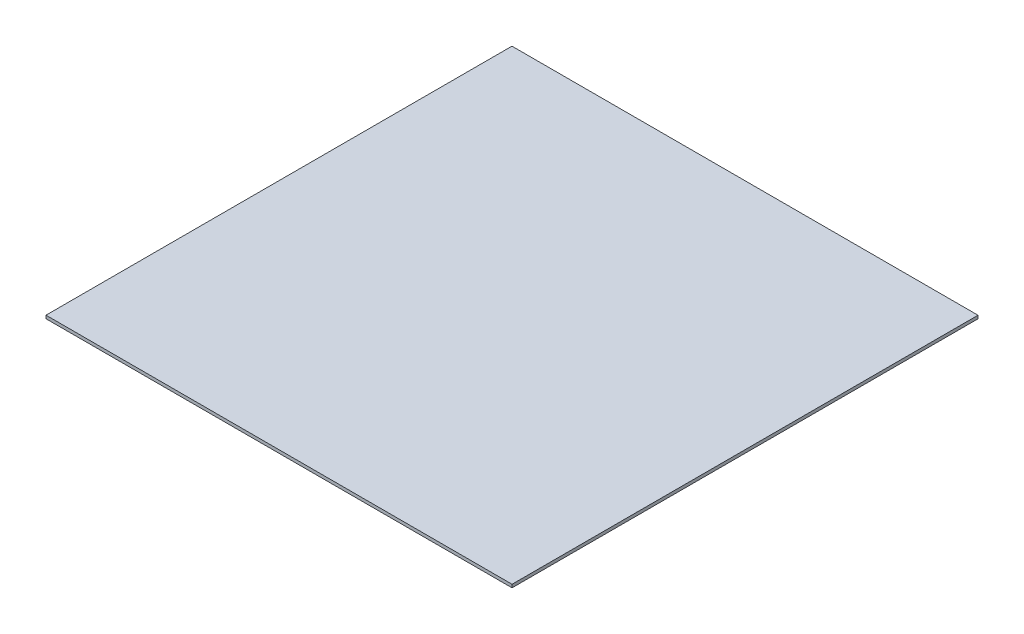
ISO-10303-21;
HEADER;
FILE_DESCRIPTION(('STEP AP214'),'2;1');
FILE_NAME('part.step','',(''),(''),'','','');
FILE_SCHEMA(('AUTOMOTIVE_DESIGN { 1 0 10303 214 1 1 1 1 }'));
ENDSEC;
DATA;
#1=APPLICATION_CONTEXT('core data for automotive mechanical design processes');
#2=APPLICATION_PROTOCOL_DEFINITION('international standard','automotive_design',2000,#1);
#3=PRODUCT_CONTEXT('',#1,'mechanical');
#4=PRODUCT('Part','Part','',(#3));
#5=PRODUCT_RELATED_PRODUCT_CATEGORY('part','',(#4));
#6=PRODUCT_DEFINITION_FORMATION('','',#4);
#7=PRODUCT_DEFINITION_CONTEXT('part definition',#1,'design');
#8=PRODUCT_DEFINITION('design','',#6,#7);
#9=PRODUCT_DEFINITION_SHAPE('','',#8);
#10=(LENGTH_UNIT() NAMED_UNIT(*) SI_UNIT(.MILLI.,.METRE.));
#11=(NAMED_UNIT(*) PLANE_ANGLE_UNIT() SI_UNIT($,.RADIAN.));
#12=(NAMED_UNIT(*) SI_UNIT($,.STERADIAN.) SOLID_ANGLE_UNIT());
#13=UNCERTAINTY_MEASURE_WITH_UNIT(LENGTH_MEASURE(1.E-05),#10,'distance_accuracy_value','');
#14=(GEOMETRIC_REPRESENTATION_CONTEXT(3) GLOBAL_UNCERTAINTY_ASSIGNED_CONTEXT((#13)) GLOBAL_UNIT_ASSIGNED_CONTEXT((#10,
#11,#12)) REPRESENTATION_CONTEXT('',''));
#15=CARTESIAN_POINT('',(0.,0.,0.));
#16=DIRECTION('',(0.,0.,1.));
#17=DIRECTION('',(1.,0.,0.));
#18=AXIS2_PLACEMENT_3D('',#15,#16,#17);
#19=CARTESIAN_POINT('',(-149.08,2.,149.05));
#20=DIRECTION('',(1.,0.,0.));
#21=DIRECTION('',(0.,0.,-1.));
#22=AXIS2_PLACEMENT_3D('',#19,#20,#21);
#23=PLANE('',#22);
#24=DIRECTION('',(0.,0.,1.));
#25=VECTOR('',#24,1.);
#26=CARTESIAN_POINT('',(-149.08,0.,149.05));
#27=LINE('',#26,#25);
#28=CARTESIAN_POINT('',(-149.08,0.,-149.05));
#29=VERTEX_POINT('',#28);
#30=CARTESIAN_POINT('',(-149.08,0.,149.05));
#31=VERTEX_POINT('',#30);
#32=EDGE_CURVE('E111',#29,#31,#27,.T.);
#33=ORIENTED_EDGE('',*,*,#32,.T.);
#34=DIRECTION('',(0.,-1.,0.));
#35=VECTOR('',#34,1.);
#36=CARTESIAN_POINT('',(-149.08,2.,149.05));
#37=LINE('',#36,#35);
#38=CARTESIAN_POINT('',(-149.08,2.,149.05));
#39=VERTEX_POINT('',#38);
#40=EDGE_CURVE('E11',#39,#31,#37,.T.);
#41=ORIENTED_EDGE('',*,*,#40,.F.);
#42=DIRECTION('',(0.,0.,1.));
#43=VECTOR('',#42,1.);
#44=CARTESIAN_POINT('',(-149.08,2.,149.05));
#45=LINE('',#44,#43);
#46=CARTESIAN_POINT('',(-149.08,2.,-149.05));
#47=VERTEX_POINT('',#46);
#48=EDGE_CURVE('E95',#47,#39,#45,.T.);
#49=ORIENTED_EDGE('',*,*,#48,.F.);
#50=DIRECTION('',(0.,-1.,0.));
#51=VECTOR('',#50,1.);
#52=CARTESIAN_POINT('',(-149.08,2.,-149.05));
#53=LINE('',#52,#51);
#54=EDGE_CURVE('E107',#47,#29,#53,.T.);
#55=ORIENTED_EDGE('',*,*,#54,.T.);
#56=EDGE_LOOP('',(#33,#41,#49,#55));
#57=FACE_BOUND('',#56,.T.);
#58=ADVANCED_FACE('F43',(#57),#23,.F.);
#59=CARTESIAN_POINT('',(149.08,2.,149.05));
#60=DIRECTION('',(0.,0.,-1.));
#61=DIRECTION('',(-1.,0.,0.));
#62=AXIS2_PLACEMENT_3D('',#59,#60,#61);
#63=PLANE('',#62);
#64=DIRECTION('',(1.,0.,0.));
#65=VECTOR('',#64,1.);
#66=CARTESIAN_POINT('',(149.08,0.,149.05));
#67=LINE('',#66,#65);
#68=CARTESIAN_POINT('',(149.08,0.,149.05));
#69=VERTEX_POINT('',#68);
#70=EDGE_CURVE('E100',#31,#69,#67,.T.);
#71=ORIENTED_EDGE('',*,*,#70,.T.);
#72=DIRECTION('',(0.,-1.,0.));
#73=VECTOR('',#72,1.);
#74=CARTESIAN_POINT('',(149.08,2.,149.05));
#75=LINE('',#74,#73);
#76=CARTESIAN_POINT('',(149.08,2.,149.05));
#77=VERTEX_POINT('',#76);
#78=EDGE_CURVE('E52',#77,#69,#75,.T.);
#79=ORIENTED_EDGE('',*,*,#78,.F.);
#80=DIRECTION('',(1.,0.,0.));
#81=VECTOR('',#80,1.);
#82=CARTESIAN_POINT('',(149.08,2.,149.05));
#83=LINE('',#82,#81);
#84=EDGE_CURVE('E90',#39,#77,#83,.T.);
#85=ORIENTED_EDGE('',*,*,#84,.F.);
#86=ORIENTED_EDGE('',*,*,#40,.T.);
#87=EDGE_LOOP('',(#71,#79,#85,#86));
#88=FACE_BOUND('',#87,.T.);
#89=ADVANCED_FACE('F99',(#88),#63,.F.);
#90=CARTESIAN_POINT('',(149.08,2.,149.05));
#91=DIRECTION('',(-1.,0.,0.));
#92=DIRECTION('',(0.,0.,1.));
#93=AXIS2_PLACEMENT_3D('',#90,#91,#92);
#94=PLANE('',#93);
#95=DIRECTION('',(0.,0.,-1.));
#96=VECTOR('',#95,1.);
#97=CARTESIAN_POINT('',(149.08,0.,149.05));
#98=LINE('',#97,#96);
#99=CARTESIAN_POINT('',(149.08,0.,-149.05));
#100=VERTEX_POINT('',#99);
#101=EDGE_CURVE('E77',#69,#100,#98,.T.);
#102=ORIENTED_EDGE('',*,*,#101,.T.);
#103=DIRECTION('',(0.,-1.,0.));
#104=VECTOR('',#103,1.);
#105=CARTESIAN_POINT('',(149.08,2.,-149.05));
#106=LINE('',#105,#104);
#107=CARTESIAN_POINT('',(149.08,2.,-149.05));
#108=VERTEX_POINT('',#107);
#109=EDGE_CURVE('E102',#108,#100,#106,.T.);
#110=ORIENTED_EDGE('',*,*,#109,.F.);
#111=DIRECTION('',(0.,0.,-1.));
#112=VECTOR('',#111,1.);
#113=CARTESIAN_POINT('',(149.08,2.,149.05));
#114=LINE('',#113,#112);
#115=EDGE_CURVE('E93',#77,#108,#114,.T.);
#116=ORIENTED_EDGE('',*,*,#115,.F.);
#117=ORIENTED_EDGE('',*,*,#78,.T.);
#118=EDGE_LOOP('',(#102,#110,#116,#117));
#119=FACE_BOUND('',#118,.T.);
#120=ADVANCED_FACE('F103',(#119),#94,.F.);
#121=CARTESIAN_POINT('',(149.08,2.,-149.05));
#122=DIRECTION('',(0.,0.,1.));
#123=DIRECTION('',(1.,0.,0.));
#124=AXIS2_PLACEMENT_3D('',#121,#122,#123);
#125=PLANE('',#124);
#126=DIRECTION('',(-1.,0.,0.));
#127=VECTOR('',#126,1.);
#128=CARTESIAN_POINT('',(149.08,0.,-149.05));
#129=LINE('',#128,#127);
#130=EDGE_CURVE('E83',#100,#29,#129,.T.);
#131=ORIENTED_EDGE('',*,*,#130,.T.);
#132=ORIENTED_EDGE('',*,*,#54,.F.);
#133=DIRECTION('',(-1.,0.,0.));
#134=VECTOR('',#133,1.);
#135=CARTESIAN_POINT('',(149.08,2.,-149.05));
#136=LINE('',#135,#134);
#137=EDGE_CURVE('E60',#108,#47,#136,.T.);
#138=ORIENTED_EDGE('',*,*,#137,.F.);
#139=ORIENTED_EDGE('',*,*,#109,.T.);
#140=EDGE_LOOP('',(#131,#132,#138,#139));
#141=FACE_BOUND('',#140,.T.);
#142=ADVANCED_FACE('F124',(#141),#125,.F.);
#143=CARTESIAN_POINT('',(0.,2.,0.));
#144=DIRECTION('',(0.,1.,0.));
#145=DIRECTION('',(0.,0.,1.));
#146=AXIS2_PLACEMENT_3D('',#143,#144,#145);
#147=PLANE('',#146);
#148=ORIENTED_EDGE('',*,*,#48,.T.);
#149=ORIENTED_EDGE('',*,*,#84,.T.);
#150=ORIENTED_EDGE('',*,*,#115,.T.);
#151=ORIENTED_EDGE('',*,*,#137,.T.);
#152=EDGE_LOOP('',(#148,#149,#150,#151));
#153=FACE_BOUND('',#152,.T.);
#154=ADVANCED_FACE('F91',(#153),#147,.T.);
#155=CARTESIAN_POINT('',(0.,0.,0.));
#156=DIRECTION('',(0.,1.,0.));
#157=DIRECTION('',(0.,0.,1.));
#158=AXIS2_PLACEMENT_3D('',#155,#156,#157);
#159=PLANE('',#158);
#160=ORIENTED_EDGE('',*,*,#32,.F.);
#161=ORIENTED_EDGE('',*,*,#130,.F.);
#162=ORIENTED_EDGE('',*,*,#101,.F.);
#163=ORIENTED_EDGE('',*,*,#70,.F.);
#164=EDGE_LOOP('',(#160,#161,#162,#163));
#165=FACE_BOUND('',#164,.T.);
#166=ADVANCED_FACE('F127',(#165),#159,.F.);
#167=CLOSED_SHELL('',(#58,#89,#120,#142,#154,#166));
#168=MANIFOLD_SOLID_BREP('B2',#167);
#169=ADVANCED_BREP_SHAPE_REPRESENTATION('',(#18,#168),#14);
#170=SHAPE_DEFINITION_REPRESENTATION(#9,#169);
ENDSEC;
END-ISO-10303-21;
